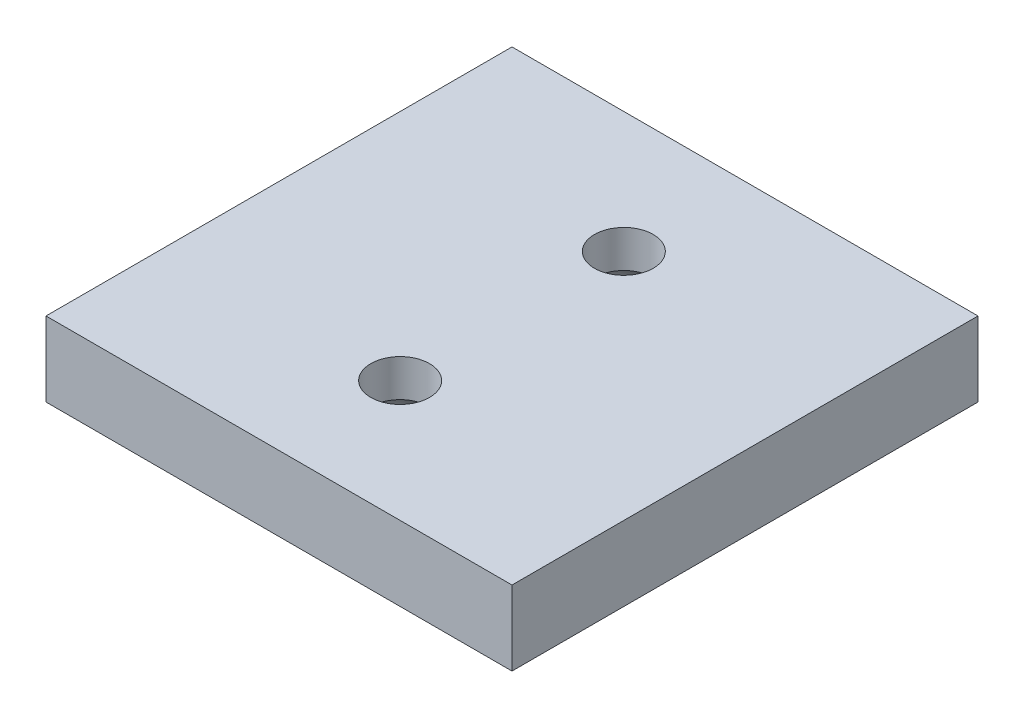
ISO-10303-21;
HEADER;
FILE_DESCRIPTION(('STEP AP214'),'2;1');
FILE_NAME('part.step','',(''),(''),'','','');
FILE_SCHEMA(('AUTOMOTIVE_DESIGN { 1 0 10303 214 1 1 1 1 }'));
ENDSEC;
DATA;
#1=APPLICATION_CONTEXT('core data for automotive mechanical design processes');
#2=APPLICATION_PROTOCOL_DEFINITION('international standard','automotive_design',2000,#1);
#3=PRODUCT_CONTEXT('',#1,'mechanical');
#4=PRODUCT('Part','Part','',(#3));
#5=PRODUCT_RELATED_PRODUCT_CATEGORY('part','',(#4));
#6=PRODUCT_DEFINITION_FORMATION('','',#4);
#7=PRODUCT_DEFINITION_CONTEXT('part definition',#1,'design');
#8=PRODUCT_DEFINITION('design','',#6,#7);
#9=PRODUCT_DEFINITION_SHAPE('','',#8);
#10=(LENGTH_UNIT() NAMED_UNIT(*) SI_UNIT(.MILLI.,.METRE.));
#11=(NAMED_UNIT(*) PLANE_ANGLE_UNIT() SI_UNIT($,.RADIAN.));
#12=(NAMED_UNIT(*) SI_UNIT($,.STERADIAN.) SOLID_ANGLE_UNIT());
#13=UNCERTAINTY_MEASURE_WITH_UNIT(LENGTH_MEASURE(1.E-05),#10,'distance_accuracy_value','');
#14=(GEOMETRIC_REPRESENTATION_CONTEXT(3) GLOBAL_UNCERTAINTY_ASSIGNED_CONTEXT((#13)) GLOBAL_UNIT_ASSIGNED_CONTEXT((#10,
#11,#12)) REPRESENTATION_CONTEXT('',''));
#15=CARTESIAN_POINT('',(0.,0.,0.));
#16=DIRECTION('',(0.,0.,1.));
#17=DIRECTION('',(1.,0.,0.));
#18=AXIS2_PLACEMENT_3D('',#15,#16,#17);
#19=CARTESIAN_POINT('',(0.,0.,0.));
#20=DIRECTION('',(0.,1.,0.));
#21=DIRECTION('',(0.,0.,1.));
#22=AXIS2_PLACEMENT_3D('',#19,#20,#21);
#23=PLANE('',#22);
#24=CARTESIAN_POINT('',(0.,0.,12.));
#25=DIRECTION('',(0.,1.,0.));
#26=DIRECTION('',(0.,0.,1.));
#27=AXIS2_PLACEMENT_3D('',#24,#25,#26);
#28=CIRCLE('',#27,6.);
#29=CARTESIAN_POINT('',(0.,0.,18.));
#30=VERTEX_POINT('',#29);
#31=EDGE_CURVE('E104',#30,#30,#28,.T.);
#32=ORIENTED_EDGE('',*,*,#31,.T.);
#33=EDGE_LOOP('',(#32));
#34=FACE_BOUND('',#33,.T.);
#35=DIRECTION('',(0.,0.,-1.));
#36=VECTOR('',#35,1.);
#37=CARTESIAN_POINT('',(25.,0.,-25.));
#38=LINE('',#37,#36);
#39=CARTESIAN_POINT('',(25.,0.,25.));
#40=VERTEX_POINT('',#39);
#41=CARTESIAN_POINT('',(25.,0.,-25.));
#42=VERTEX_POINT('',#41);
#43=EDGE_CURVE('E101',#40,#42,#38,.T.);
#44=ORIENTED_EDGE('',*,*,#43,.F.);
#45=DIRECTION('',(1.,0.,0.));
#46=VECTOR('',#45,1.);
#47=CARTESIAN_POINT('',(-25.,0.,25.));
#48=LINE('',#47,#46);
#49=CARTESIAN_POINT('',(-25.,0.,25.));
#50=VERTEX_POINT('',#49);
#51=EDGE_CURVE('E73',#50,#40,#48,.T.);
#52=ORIENTED_EDGE('',*,*,#51,.F.);
#53=DIRECTION('',(0.,0.,1.));
#54=VECTOR('',#53,1.);
#55=CARTESIAN_POINT('',(-25.,0.,-25.));
#56=LINE('',#55,#54);
#57=CARTESIAN_POINT('',(-25.,0.,-25.));
#58=VERTEX_POINT('',#57);
#59=EDGE_CURVE('E67',#58,#50,#56,.T.);
#60=ORIENTED_EDGE('',*,*,#59,.F.);
#61=DIRECTION('',(-1.,0.,0.));
#62=VECTOR('',#61,1.);
#63=CARTESIAN_POINT('',(-25.,0.,-25.));
#64=LINE('',#63,#62);
#65=EDGE_CURVE('E91',#42,#58,#64,.T.);
#66=ORIENTED_EDGE('',*,*,#65,.F.);
#67=EDGE_LOOP('',(#44,#52,#60,#66));
#68=FACE_BOUND('',#67,.T.);
#69=CARTESIAN_POINT('',(0.,0.,-12.));
#70=DIRECTION('',(0.,1.,0.));
#71=DIRECTION('',(0.,0.,-1.));
#72=AXIS2_PLACEMENT_3D('',#69,#70,#71);
#73=CIRCLE('',#72,6.);
#74=CARTESIAN_POINT('',(0.,0.,-18.));
#75=VERTEX_POINT('',#74);
#76=EDGE_CURVE('E236',#75,#75,#73,.T.);
#77=ORIENTED_EDGE('',*,*,#76,.T.);
#78=EDGE_LOOP('',(#77));
#79=FACE_BOUND('',#78,.T.);
#80=ADVANCED_FACE('F33',(#34,#68,#79),#23,.F.);
#81=CARTESIAN_POINT('',(25.,8.,-25.));
#82=DIRECTION('',(-1.,0.,0.));
#83=DIRECTION('',(0.,0.,1.));
#84=AXIS2_PLACEMENT_3D('',#81,#82,#83);
#85=PLANE('',#84);
#86=ORIENTED_EDGE('',*,*,#43,.T.);
#87=DIRECTION('',(0.,-1.,0.));
#88=VECTOR('',#87,1.);
#89=CARTESIAN_POINT('',(25.,8.,-25.));
#90=LINE('',#89,#88);
#91=CARTESIAN_POINT('',(25.,8.,-25.));
#92=VERTEX_POINT('',#91);
#93=EDGE_CURVE('E92',#92,#42,#90,.T.);
#94=ORIENTED_EDGE('',*,*,#93,.F.);
#95=DIRECTION('',(0.,0.,-1.));
#96=VECTOR('',#95,1.);
#97=CARTESIAN_POINT('',(25.,8.,-25.));
#98=LINE('',#97,#96);
#99=CARTESIAN_POINT('',(25.,8.,25.));
#100=VERTEX_POINT('',#99);
#101=EDGE_CURVE('E86',#100,#92,#98,.T.);
#102=ORIENTED_EDGE('',*,*,#101,.F.);
#103=DIRECTION('',(0.,-1.,0.));
#104=VECTOR('',#103,1.);
#105=CARTESIAN_POINT('',(25.,8.,25.));
#106=LINE('',#105,#104);
#107=EDGE_CURVE('E97',#100,#40,#106,.T.);
#108=ORIENTED_EDGE('',*,*,#107,.T.);
#109=EDGE_LOOP('',(#86,#94,#102,#108));
#110=FACE_BOUND('',#109,.T.);
#111=ADVANCED_FACE('F131',(#110),#85,.F.);
#112=CARTESIAN_POINT('',(-25.,8.,-25.));
#113=DIRECTION('',(0.,0.,1.));
#114=DIRECTION('',(1.,0.,0.));
#115=AXIS2_PLACEMENT_3D('',#112,#113,#114);
#116=PLANE('',#115);
#117=ORIENTED_EDGE('',*,*,#65,.T.);
#118=DIRECTION('',(0.,-1.,0.));
#119=VECTOR('',#118,1.);
#120=CARTESIAN_POINT('',(-25.,8.,-25.));
#121=LINE('',#120,#119);
#122=CARTESIAN_POINT('',(-25.,8.,-25.));
#123=VERTEX_POINT('',#122);
#124=EDGE_CURVE('E89',#123,#58,#121,.T.);
#125=ORIENTED_EDGE('',*,*,#124,.F.);
#126=DIRECTION('',(-1.,0.,0.));
#127=VECTOR('',#126,1.);
#128=CARTESIAN_POINT('',(-25.,8.,-25.));
#129=LINE('',#128,#127);
#130=EDGE_CURVE('E81',#92,#123,#129,.T.);
#131=ORIENTED_EDGE('',*,*,#130,.F.);
#132=ORIENTED_EDGE('',*,*,#93,.T.);
#133=EDGE_LOOP('',(#117,#125,#131,#132));
#134=FACE_BOUND('',#133,.T.);
#135=ADVANCED_FACE('F90',(#134),#116,.F.);
#136=CARTESIAN_POINT('',(-25.,8.,-25.));
#137=DIRECTION('',(1.,0.,0.));
#138=DIRECTION('',(0.,0.,-1.));
#139=AXIS2_PLACEMENT_3D('',#136,#137,#138);
#140=PLANE('',#139);
#141=ORIENTED_EDGE('',*,*,#59,.T.);
#142=DIRECTION('',(0.,-1.,0.));
#143=VECTOR('',#142,1.);
#144=CARTESIAN_POINT('',(-25.,8.,25.));
#145=LINE('',#144,#143);
#146=CARTESIAN_POINT('',(-25.,8.,25.));
#147=VERTEX_POINT('',#146);
#148=EDGE_CURVE('E93',#147,#50,#145,.T.);
#149=ORIENTED_EDGE('',*,*,#148,.F.);
#150=DIRECTION('',(0.,0.,1.));
#151=VECTOR('',#150,1.);
#152=CARTESIAN_POINT('',(-25.,8.,-25.));
#153=LINE('',#152,#151);
#154=EDGE_CURVE('E84',#123,#147,#153,.T.);
#155=ORIENTED_EDGE('',*,*,#154,.F.);
#156=ORIENTED_EDGE('',*,*,#124,.T.);
#157=EDGE_LOOP('',(#141,#149,#155,#156));
#158=FACE_BOUND('',#157,.T.);
#159=ADVANCED_FACE('F95',(#158),#140,.F.);
#160=CARTESIAN_POINT('',(-25.,8.,25.));
#161=DIRECTION('',(0.,0.,-1.));
#162=DIRECTION('',(-1.,0.,0.));
#163=AXIS2_PLACEMENT_3D('',#160,#161,#162);
#164=PLANE('',#163);
#165=ORIENTED_EDGE('',*,*,#51,.T.);
#166=ORIENTED_EDGE('',*,*,#107,.F.);
#167=DIRECTION('',(1.,0.,0.));
#168=VECTOR('',#167,1.);
#169=CARTESIAN_POINT('',(-25.,8.,25.));
#170=LINE('',#169,#168);
#171=EDGE_CURVE('E50',#147,#100,#170,.T.);
#172=ORIENTED_EDGE('',*,*,#171,.F.);
#173=ORIENTED_EDGE('',*,*,#148,.T.);
#174=EDGE_LOOP('',(#165,#166,#172,#173));
#175=FACE_BOUND('',#174,.T.);
#176=ADVANCED_FACE('F143',(#175),#164,.F.);
#177=CARTESIAN_POINT('',(0.,8.,0.));
#178=DIRECTION('',(0.,1.,0.));
#179=DIRECTION('',(0.,0.,1.));
#180=AXIS2_PLACEMENT_3D('',#177,#178,#179);
#181=PLANE('',#180);
#182=CARTESIAN_POINT('',(0.,8.,12.));
#183=DIRECTION('',(0.,-1.,0.));
#184=DIRECTION('',(0.,0.,1.));
#185=AXIS2_PLACEMENT_3D('',#182,#183,#184);
#186=CIRCLE('',#185,3.15);
#187=CARTESIAN_POINT('',(0.,8.,15.15));
#188=VERTEX_POINT('',#187);
#189=EDGE_CURVE('E234',#188,#188,#186,.T.);
#190=ORIENTED_EDGE('',*,*,#189,.T.);
#191=EDGE_LOOP('',(#190));
#192=FACE_BOUND('',#191,.T.);
#193=CARTESIAN_POINT('',(0.,8.,-12.));
#194=DIRECTION('',(0.,-1.,0.));
#195=DIRECTION('',(0.,0.,-1.));
#196=AXIS2_PLACEMENT_3D('',#193,#194,#195);
#197=CIRCLE('',#196,3.15);
#198=CARTESIAN_POINT('',(0.,8.,-15.15));
#199=VERTEX_POINT('',#198);
#200=EDGE_CURVE('E230',#199,#199,#197,.T.);
#201=ORIENTED_EDGE('',*,*,#200,.T.);
#202=EDGE_LOOP('',(#201));
#203=FACE_BOUND('',#202,.T.);
#204=ORIENTED_EDGE('',*,*,#101,.T.);
#205=ORIENTED_EDGE('',*,*,#130,.T.);
#206=ORIENTED_EDGE('',*,*,#154,.T.);
#207=ORIENTED_EDGE('',*,*,#171,.T.);
#208=EDGE_LOOP('',(#204,#205,#206,#207));
#209=FACE_BOUND('',#208,.T.);
#210=ADVANCED_FACE('F82',(#192,#203,#209),#181,.T.);
#211=CARTESIAN_POINT('',(0.,4.,12.));
#212=DIRECTION('',(0.,-1.,0.));
#213=DIRECTION('',(0.,0.,-1.));
#214=AXIS2_PLACEMENT_3D('',#211,#212,#213);
#215=CYLINDRICAL_SURFACE('',#214,6.);
#216=CARTESIAN_POINT('',(0.,0.168877449101895,12.));
#217=DIRECTION('',(0.,1.,0.));
#218=DIRECTION('',(0.,0.,1.));
#219=AXIS2_PLACEMENT_3D('',#216,#217,#218);
#220=CIRCLE('',#219,6.);
#221=CARTESIAN_POINT('',(0.,0.168877449101895,18.));
#222=VERTEX_POINT('',#221);
#223=EDGE_CURVE('E42',#222,#222,#220,.T.);
#224=ORIENTED_EDGE('',*,*,#223,.T.);
#225=EDGE_LOOP('',(#224));
#226=FACE_BOUND('',#225,.T.);
#227=ORIENTED_EDGE('',*,*,#31,.F.);
#228=EDGE_LOOP('',(#227));
#229=FACE_BOUND('',#228,.T.);
#230=ADVANCED_FACE('F113',(#226,#229),#215,.F.);
#231=CARTESIAN_POINT('',(0.,4.,-12.));
#232=DIRECTION('',(0.,-1.,0.));
#233=DIRECTION('',(0.,0.,-1.));
#234=AXIS2_PLACEMENT_3D('',#231,#232,#233);
#235=CYLINDRICAL_SURFACE('',#234,6.);
#236=CARTESIAN_POINT('',(0.,0.168877449101895,-12.));
#237=DIRECTION('',(0.,1.,0.));
#238=DIRECTION('',(0.,0.,1.));
#239=AXIS2_PLACEMENT_3D('',#236,#237,#238);
#240=CIRCLE('',#239,6.);
#241=CARTESIAN_POINT('',(0.,0.168877449101895,-6.));
#242=VERTEX_POINT('',#241);
#243=EDGE_CURVE('E11',#242,#242,#240,.T.);
#244=ORIENTED_EDGE('',*,*,#243,.T.);
#245=EDGE_LOOP('',(#244));
#246=FACE_BOUND('',#245,.T.);
#247=ORIENTED_EDGE('',*,*,#76,.F.);
#248=EDGE_LOOP('',(#247));
#249=FACE_BOUND('',#248,.T.);
#250=ADVANCED_FACE('F174',(#246,#249),#235,.F.);
#251=CARTESIAN_POINT('',(0.,8.,-12.));
#252=DIRECTION('',(0.,-1.,0.));
#253=DIRECTION('',(0.,0.,-1.));
#254=AXIS2_PLACEMENT_3D('',#251,#252,#253);
#255=CYLINDRICAL_SURFACE('',#254,3.15);
#256=ORIENTED_EDGE('',*,*,#200,.F.);
#257=EDGE_LOOP('',(#256));
#258=FACE_BOUND('',#257,.T.);
#259=CARTESIAN_POINT('',(0.,4.,-12.));
#260=DIRECTION('',(0.,-1.,0.));
#261=DIRECTION('',(0.,0.,-1.));
#262=AXIS2_PLACEMENT_3D('',#259,#260,#261);
#263=CIRCLE('',#262,3.15);
#264=CARTESIAN_POINT('',(0.,4.,-15.15));
#265=VERTEX_POINT('',#264);
#266=EDGE_CURVE('E233',#265,#265,#263,.T.);
#267=ORIENTED_EDGE('',*,*,#266,.T.);
#268=EDGE_LOOP('',(#267));
#269=FACE_BOUND('',#268,.T.);
#270=ADVANCED_FACE('F125',(#258,#269),#255,.F.);
#271=CARTESIAN_POINT('',(0.,8.,12.));
#272=DIRECTION('',(0.,-1.,0.));
#273=DIRECTION('',(0.,0.,-1.));
#274=AXIS2_PLACEMENT_3D('',#271,#272,#273);
#275=CYLINDRICAL_SURFACE('',#274,3.15);
#276=ORIENTED_EDGE('',*,*,#189,.F.);
#277=EDGE_LOOP('',(#276));
#278=FACE_BOUND('',#277,.T.);
#279=CARTESIAN_POINT('',(0.,4.,12.));
#280=DIRECTION('',(0.,-1.,0.));
#281=DIRECTION('',(0.,0.,1.));
#282=AXIS2_PLACEMENT_3D('',#279,#280,#281);
#283=CIRCLE('',#282,3.15);
#284=CARTESIAN_POINT('',(0.,4.,15.15));
#285=VERTEX_POINT('',#284);
#286=EDGE_CURVE('E239',#285,#285,#283,.T.);
#287=ORIENTED_EDGE('',*,*,#286,.T.);
#288=EDGE_LOOP('',(#287));
#289=FACE_BOUND('',#288,.T.);
#290=ADVANCED_FACE('F118',(#278,#289),#275,.F.);
#291=CARTESIAN_POINT('',(0.,0.168877449101895,12.));
#292=DIRECTION('',(0.,1.,0.));
#293=DIRECTION('',(0.,0.,1.));
#294=AXIS2_PLACEMENT_3D('',#291,#292,#293);
#295=DEGENERATE_TOROIDAL_SURFACE('',#294,2.,4.,.T.);
#296=ORIENTED_EDGE('',*,*,#286,.F.);
#297=EDGE_LOOP('',(#296));
#298=FACE_BOUND('',#297,.T.);
#299=ORIENTED_EDGE('',*,*,#223,.F.);
#300=EDGE_LOOP('',(#299));
#301=FACE_BOUND('',#300,.T.);
#302=ADVANCED_FACE('F116',(#298,#301),#295,.F.);
#303=CARTESIAN_POINT('',(0.,0.168877449101895,-12.));
#304=DIRECTION('',(0.,1.,0.));
#305=DIRECTION('',(0.,0.,1.));
#306=AXIS2_PLACEMENT_3D('',#303,#304,#305);
#307=DEGENERATE_TOROIDAL_SURFACE('',#306,2.,4.,.T.);
#308=ORIENTED_EDGE('',*,*,#266,.F.);
#309=EDGE_LOOP('',(#308));
#310=FACE_BOUND('',#309,.T.);
#311=ORIENTED_EDGE('',*,*,#243,.F.);
#312=EDGE_LOOP('',(#311));
#313=FACE_BOUND('',#312,.T.);
#314=ADVANCED_FACE('F35',(#310,#313),#307,.F.);
#315=CLOSED_SHELL('',(#80,#111,#135,#159,#176,#210,#230,#250,#270,#290,#302,#314));
#316=MANIFOLD_SOLID_BREP('B2',#315);
#317=ADVANCED_BREP_SHAPE_REPRESENTATION('',(#18,#316),#14);
#318=SHAPE_DEFINITION_REPRESENTATION(#9,#317);
ENDSEC;
END-ISO-10303-21;
